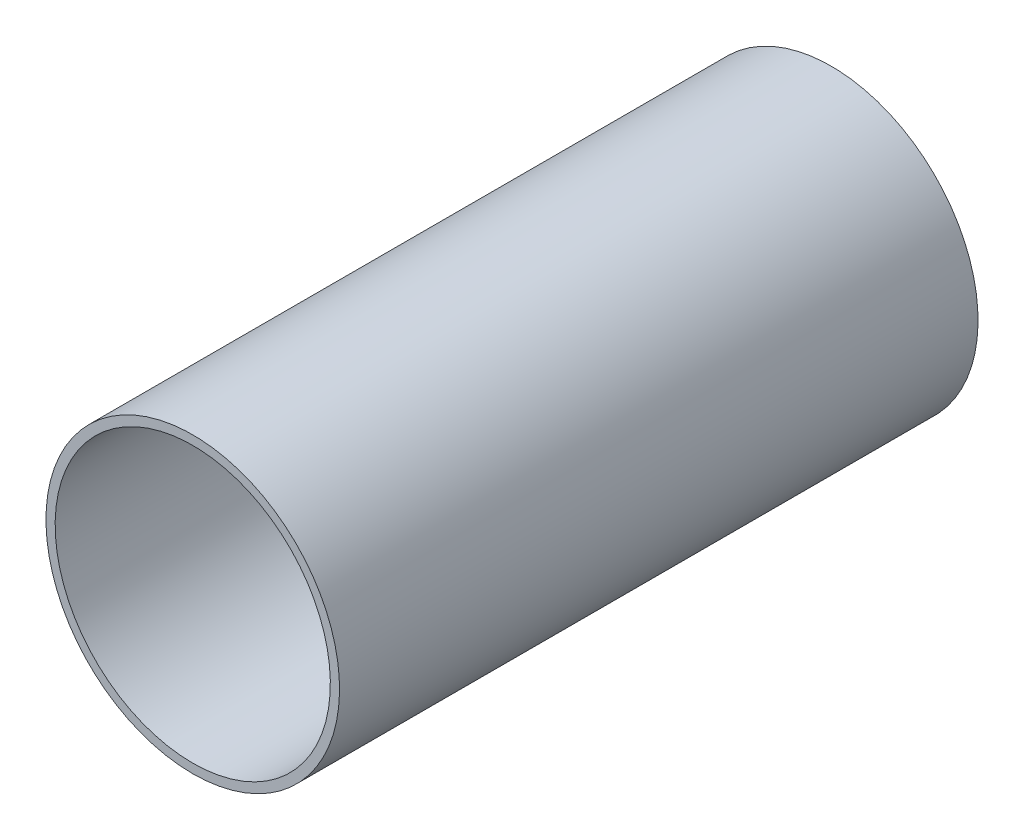
ISO-10303-21;
HEADER;
FILE_DESCRIPTION(('STEP AP214'),'2;1');
FILE_NAME('part.step','',(''),(''),'','','');
FILE_SCHEMA(('AUTOMOTIVE_DESIGN { 1 0 10303 214 1 1 1 1 }'));
ENDSEC;
DATA;
#1=APPLICATION_CONTEXT('core data for automotive mechanical design processes');
#2=APPLICATION_PROTOCOL_DEFINITION('international standard','automotive_design',2000,#1);
#3=PRODUCT_CONTEXT('',#1,'mechanical');
#4=PRODUCT('Part','Part','',(#3));
#5=PRODUCT_RELATED_PRODUCT_CATEGORY('part','',(#4));
#6=PRODUCT_DEFINITION_FORMATION('','',#4);
#7=PRODUCT_DEFINITION_CONTEXT('part definition',#1,'design');
#8=PRODUCT_DEFINITION('design','',#6,#7);
#9=PRODUCT_DEFINITION_SHAPE('','',#8);
#10=(LENGTH_UNIT() NAMED_UNIT(*) SI_UNIT(.MILLI.,.METRE.));
#11=(NAMED_UNIT(*) PLANE_ANGLE_UNIT() SI_UNIT($,.RADIAN.));
#12=(NAMED_UNIT(*) SI_UNIT($,.STERADIAN.) SOLID_ANGLE_UNIT());
#13=UNCERTAINTY_MEASURE_WITH_UNIT(LENGTH_MEASURE(1.E-05),#10,'distance_accuracy_value','');
#14=(GEOMETRIC_REPRESENTATION_CONTEXT(3) GLOBAL_UNCERTAINTY_ASSIGNED_CONTEXT((#13)) GLOBAL_UNIT_ASSIGNED_CONTEXT((#10,
#11,#12)) REPRESENTATION_CONTEXT('',''));
#15=CARTESIAN_POINT('',(0.,0.,0.));
#16=DIRECTION('',(0.,0.,1.));
#17=DIRECTION('',(1.,0.,0.));
#18=AXIS2_PLACEMENT_3D('',#15,#16,#17);
#19=CARTESIAN_POINT('',(166.497,-133.477,-0.045));
#20=DIRECTION('',(0.,0.,-1.));
#21=DIRECTION('',(0.,-1.,0.));
#22=AXIS2_PLACEMENT_3D('',#19,#20,#21);
#23=CYLINDRICAL_SURFACE('',#22,0.375);
#24=CARTESIAN_POINT('',(166.497,-133.477,-0.035));
#25=DIRECTION('',(0.,0.,-1.));
#26=DIRECTION('',(0.,-1.,0.));
#27=AXIS2_PLACEMENT_3D('',#24,#25,#26);
#28=CIRCLE('',#27,0.375);
#29=CARTESIAN_POINT('',(166.497,-133.852,-0.035));
#30=VERTEX_POINT('',#29);
#31=EDGE_CURVE('E64',#30,#30,#28,.T.);
#32=ORIENTED_EDGE('',*,*,#31,.T.);
#33=DIRECTION('',(0.,0.,1.));
#34=VECTOR('',#33,1.);
#35=CARTESIAN_POINT('',(166.497,-133.852,-0.045));
#36=LINE('',#35,#34);
#37=CARTESIAN_POINT('',(166.497,-133.852,1.705));
#38=VERTEX_POINT('',#37);
#39=EDGE_CURVE('E11',#30,#38,#36,.T.);
#40=ORIENTED_EDGE('',*,*,#39,.T.);
#41=CARTESIAN_POINT('',(166.497,-133.477,1.705));
#42=DIRECTION('',(0.,0.,-1.));
#43=DIRECTION('',(0.,-1.,0.));
#44=AXIS2_PLACEMENT_3D('',#41,#42,#43);
#45=CIRCLE('',#44,0.375);
#46=EDGE_CURVE('E25',#38,#38,#45,.T.);
#47=ORIENTED_EDGE('',*,*,#46,.F.);
#48=ORIENTED_EDGE('',*,*,#39,.F.);
#49=EDGE_LOOP('',(#32,#40,#47,#48));
#50=FACE_BOUND('',#49,.T.);
#51=ADVANCED_FACE('F17',(#50),#23,.F.);
#52=CARTESIAN_POINT('',(166.497,-133.877,1.705));
#53=DIRECTION('',(0.,0.,1.));
#54=DIRECTION('',(1.,0.,0.));
#55=AXIS2_PLACEMENT_3D('',#52,#53,#54);
#56=PLANE('',#55);
#57=ORIENTED_EDGE('',*,*,#46,.T.);
#58=EDGE_LOOP('',(#57));
#59=FACE_BOUND('',#58,.T.);
#60=CARTESIAN_POINT('',(166.497,-133.477,1.705));
#61=DIRECTION('',(0.,0.,1.));
#62=DIRECTION('',(0.,-1.,0.));
#63=AXIS2_PLACEMENT_3D('',#60,#61,#62);
#64=CIRCLE('',#63,0.4);
#65=CARTESIAN_POINT('',(166.497,-133.877,1.705));
#66=VERTEX_POINT('',#65);
#67=EDGE_CURVE('E56',#66,#66,#64,.T.);
#68=ORIENTED_EDGE('',*,*,#67,.T.);
#69=EDGE_LOOP('',(#68));
#70=FACE_BOUND('',#69,.T.);
#71=ADVANCED_FACE('F73',(#59,#70),#56,.T.);
#72=CARTESIAN_POINT('',(166.497,-133.877,-0.035));
#73=DIRECTION('',(0.,0.,1.));
#74=DIRECTION('',(1.,0.,0.));
#75=AXIS2_PLACEMENT_3D('',#72,#73,#74);
#76=PLANE('',#75);
#77=ORIENTED_EDGE('',*,*,#31,.F.);
#78=EDGE_LOOP('',(#77));
#79=FACE_BOUND('',#78,.T.);
#80=CARTESIAN_POINT('',(166.497,-133.477,-0.035));
#81=DIRECTION('',(0.,0.,1.));
#82=DIRECTION('',(0.,-1.,0.));
#83=AXIS2_PLACEMENT_3D('',#80,#81,#82);
#84=CIRCLE('',#83,0.4);
#85=CARTESIAN_POINT('',(166.497,-133.877,-0.035));
#86=VERTEX_POINT('',#85);
#87=EDGE_CURVE('E55',#86,#86,#84,.T.);
#88=ORIENTED_EDGE('',*,*,#87,.F.);
#89=EDGE_LOOP('',(#88));
#90=FACE_BOUND('',#89,.T.);
#91=ADVANCED_FACE('F82',(#79,#90),#76,.F.);
#92=CARTESIAN_POINT('',(166.497,-133.477,-0.035));
#93=DIRECTION('',(0.,0.,-1.));
#94=DIRECTION('',(0.,-1.,0.));
#95=AXIS2_PLACEMENT_3D('',#92,#93,#94);
#96=CYLINDRICAL_SURFACE('',#95,0.4);
#97=ORIENTED_EDGE('',*,*,#87,.T.);
#98=DIRECTION('',(0.,0.,1.));
#99=VECTOR('',#98,1.);
#100=CARTESIAN_POINT('',(166.497,-133.877,-0.035));
#101=LINE('',#100,#99);
#102=EDGE_CURVE('E52',#86,#66,#101,.T.);
#103=ORIENTED_EDGE('',*,*,#102,.T.);
#104=ORIENTED_EDGE('',*,*,#67,.F.);
#105=ORIENTED_EDGE('',*,*,#102,.F.);
#106=EDGE_LOOP('',(#97,#103,#104,#105));
#107=FACE_BOUND('',#106,.T.);
#108=ADVANCED_FACE('F53',(#107),#96,.T.);
#109=CLOSED_SHELL('',(#51,#71,#91,#108));
#110=MANIFOLD_SOLID_BREP('B1',#109);
#111=ADVANCED_BREP_SHAPE_REPRESENTATION('',(#18,#110),#14);
#112=SHAPE_DEFINITION_REPRESENTATION(#9,#111);
ENDSEC;
END-ISO-10303-21;
